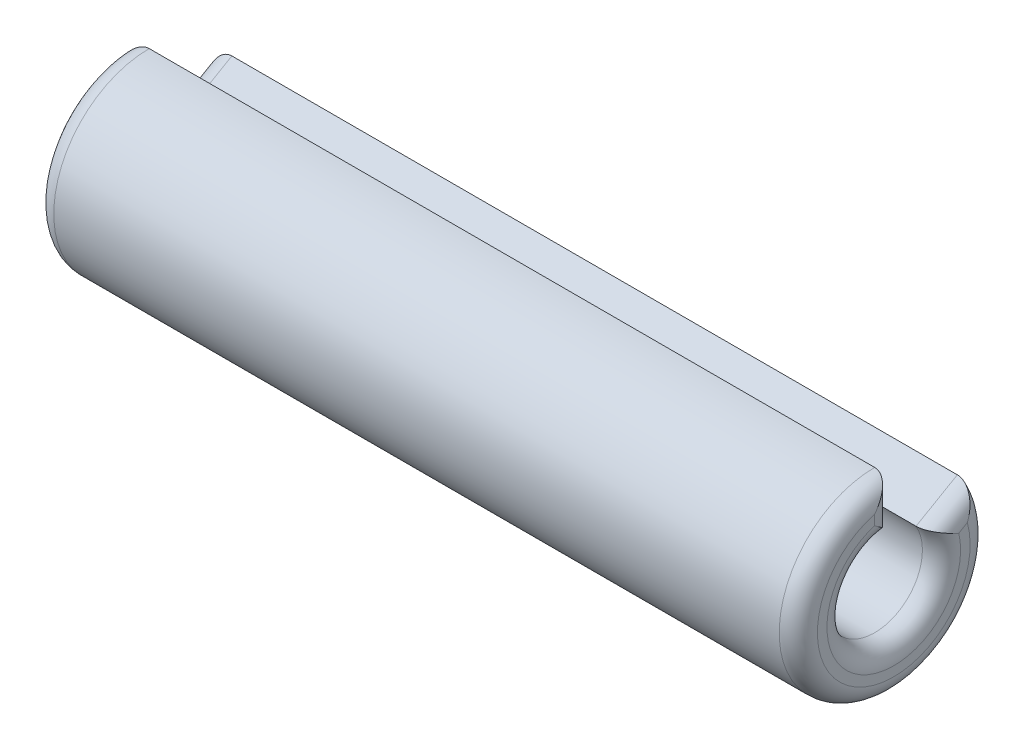
ISO-10303-21;
HEADER;
FILE_DESCRIPTION(('STEP AP214'),'2;1');
FILE_NAME('part.step','',(''),(''),'','','');
FILE_SCHEMA(('AUTOMOTIVE_DESIGN { 1 0 10303 214 1 1 1 1 }'));
ENDSEC;
DATA;
#1=APPLICATION_CONTEXT('core data for automotive mechanical design processes');
#2=APPLICATION_PROTOCOL_DEFINITION('international standard','automotive_design',2000,#1);
#3=PRODUCT_CONTEXT('',#1,'mechanical');
#4=PRODUCT('Part','Part','',(#3));
#5=PRODUCT_RELATED_PRODUCT_CATEGORY('part','',(#4));
#6=PRODUCT_DEFINITION_FORMATION('','',#4);
#7=PRODUCT_DEFINITION_CONTEXT('part definition',#1,'design');
#8=PRODUCT_DEFINITION('design','',#6,#7);
#9=PRODUCT_DEFINITION_SHAPE('','',#8);
#10=(LENGTH_UNIT() NAMED_UNIT(*) SI_UNIT(.MILLI.,.METRE.));
#11=(NAMED_UNIT(*) PLANE_ANGLE_UNIT() SI_UNIT($,.RADIAN.));
#12=(NAMED_UNIT(*) SI_UNIT($,.STERADIAN.) SOLID_ANGLE_UNIT());
#13=UNCERTAINTY_MEASURE_WITH_UNIT(LENGTH_MEASURE(1.E-05),#10,'distance_accuracy_value','');
#14=(GEOMETRIC_REPRESENTATION_CONTEXT(3) GLOBAL_UNCERTAINTY_ASSIGNED_CONTEXT((#13)) GLOBAL_UNIT_ASSIGNED_CONTEXT((#10,
#11,#12)) REPRESENTATION_CONTEXT('',''));
#15=CARTESIAN_POINT('',(0.,0.,0.));
#16=DIRECTION('',(0.,0.,1.));
#17=DIRECTION('',(1.,0.,0.));
#18=AXIS2_PLACEMENT_3D('',#15,#16,#17);
#19=CARTESIAN_POINT('',(-2.,0.250000000000005,-0.433012701892216));
#20=DIRECTION('',(1.,0.,0.));
#21=DIRECTION('',(0.,0.,-1.));
#22=AXIS2_PLACEMENT_3D('',#19,#20,#21);
#23=PLANE('',#22);
#24=CARTESIAN_POINT('',(-2.,0.,0.));
#25=DIRECTION('',(1.,0.,0.));
#26=DIRECTION('',(0.,0.,-1.));
#27=AXIS2_PLACEMENT_3D('',#24,#25,#26);
#28=CIRCLE('',#27,0.4);
#29=CARTESIAN_POINT('',(-2.,0.107046626931931,-0.385410196624967));
#30=VERTEX_POINT('',#29);
#31=CARTESIAN_POINT('',(-2.,0.387298334620742,0.1));
#32=VERTEX_POINT('',#31);
#33=EDGE_CURVE('E122',#30,#32,#28,.F.);
#34=ORIENTED_EDGE('',*,*,#33,.T.);
#35=DIRECTION('',(0.,-1.,0.));
#36=VECTOR('',#35,1.);
#37=CARTESIAN_POINT('',(-2.,0.250000000000005,0.1));
#38=LINE('',#37,#36);
#39=CARTESIAN_POINT('',(-2.,0.335410196624968,0.1));
#40=VERTEX_POINT('',#39);
#41=EDGE_CURVE('E104',#32,#40,#38,.T.);
#42=ORIENTED_EDGE('',*,*,#41,.T.);
#43=CARTESIAN_POINT('',(-2.,0.,0.));
#44=DIRECTION('',(1.,0.,0.));
#45=DIRECTION('',(0.,0.,-1.));
#46=AXIS2_PLACEMENT_3D('',#43,#44,#45);
#47=CIRCLE('',#46,0.35);
#48=CARTESIAN_POINT('',(-2.,0.0811025579340443,-0.340473750965555));
#49=VERTEX_POINT('',#48);
#50=EDGE_CURVE('E112',#40,#49,#47,.T.);
#51=ORIENTED_EDGE('',*,*,#50,.T.);
#52=DIRECTION('',(0.,-0.50000000000001,0.866025403784433));
#53=VECTOR('',#52,1.);
#54=CARTESIAN_POINT('',(-2.,0.163397459621562,-0.483012701892217));
#55=LINE('',#54,#53);
#56=EDGE_CURVE('E118',#49,#30,#55,.F.);
#57=ORIENTED_EDGE('',*,*,#56,.T.);
#58=EDGE_LOOP('',(#34,#42,#51,#57));
#59=FACE_BOUND('',#58,.T.);
#60=ADVANCED_FACE('F30',(#59),#23,.F.);
#61=CARTESIAN_POINT('',(0.,0.,0.));
#62=DIRECTION('',(-1.,0.,0.));
#63=DIRECTION('',(0.,0.,1.));
#64=AXIS2_PLACEMENT_3D('',#61,#62,#63);
#65=CYLINDRICAL_SURFACE('',#64,0.25);
#66=DIRECTION('',(1.,0.,0.));
#67=VECTOR('',#66,1.);
#68=CARTESIAN_POINT('',(-2.,0.125000000000003,-0.216506350946108));
#69=LINE('',#68,#67);
#70=CARTESIAN_POINT('',(-1.9,0.125000000000003,-0.216506350946108));
#71=VERTEX_POINT('',#70);
#72=CARTESIAN_POINT('',(1.9,0.125000000000003,-0.216506350946108));
#73=VERTEX_POINT('',#72);
#74=EDGE_CURVE('E247',#71,#73,#69,.T.);
#75=ORIENTED_EDGE('',*,*,#74,.F.);
#76=CARTESIAN_POINT('',(-1.9,0.,0.));
#77=DIRECTION('',(1.,0.,0.));
#78=DIRECTION('',(0.,0.,-1.));
#79=AXIS2_PLACEMENT_3D('',#76,#77,#78);
#80=CIRCLE('',#79,0.25);
#81=CARTESIAN_POINT('',(-1.9,0.25,0.));
#82=VERTEX_POINT('',#81);
#83=EDGE_CURVE('E142',#71,#82,#80,.F.);
#84=ORIENTED_EDGE('',*,*,#83,.T.);
#85=DIRECTION('',(1.,0.,0.));
#86=VECTOR('',#85,1.);
#87=CARTESIAN_POINT('',(-2.,0.25,0.));
#88=LINE('',#87,#86);
#89=CARTESIAN_POINT('',(1.9,0.25,0.));
#90=VERTEX_POINT('',#89);
#91=EDGE_CURVE('E253',#82,#90,#88,.T.);
#92=ORIENTED_EDGE('',*,*,#91,.T.);
#93=CARTESIAN_POINT('',(1.9,0.,0.));
#94=DIRECTION('',(-1.,0.,0.));
#95=DIRECTION('',(0.,0.,1.));
#96=AXIS2_PLACEMENT_3D('',#93,#94,#95);
#97=CIRCLE('',#96,0.25);
#98=EDGE_CURVE('E140',#90,#73,#97,.F.);
#99=ORIENTED_EDGE('',*,*,#98,.T.);
#100=EDGE_LOOP('',(#75,#84,#92,#99));
#101=FACE_BOUND('',#100,.T.);
#102=ADVANCED_FACE('F216',(#101),#65,.F.);
#103=CARTESIAN_POINT('',(2.,0.250000000000005,-0.433012701892216));
#104=DIRECTION('',(-1.,0.,0.));
#105=DIRECTION('',(0.,0.,1.));
#106=AXIS2_PLACEMENT_3D('',#103,#104,#105);
#107=PLANE('',#106);
#108=CARTESIAN_POINT('',(2.,0.,0.));
#109=DIRECTION('',(-1.,0.,0.));
#110=DIRECTION('',(0.,0.,1.));
#111=AXIS2_PLACEMENT_3D('',#108,#109,#110);
#112=CIRCLE('',#111,0.35);
#113=CARTESIAN_POINT('',(2.,0.0811025579340443,-0.340473750965555));
#114=VERTEX_POINT('',#113);
#115=CARTESIAN_POINT('',(2.,0.335410196624968,0.1));
#116=VERTEX_POINT('',#115);
#117=EDGE_CURVE('E43',#114,#116,#112,.T.);
#118=ORIENTED_EDGE('',*,*,#117,.T.);
#119=DIRECTION('',(0.,1.,0.));
#120=VECTOR('',#119,1.);
#121=CARTESIAN_POINT('',(2.,0.250000000000005,0.1));
#122=LINE('',#121,#120);
#123=CARTESIAN_POINT('',(2.,0.387298334620742,0.1));
#124=VERTEX_POINT('',#123);
#125=EDGE_CURVE('E11',#116,#124,#122,.T.);
#126=ORIENTED_EDGE('',*,*,#125,.T.);
#127=CARTESIAN_POINT('',(2.,0.,0.));
#128=DIRECTION('',(-1.,0.,0.));
#129=DIRECTION('',(0.,0.,1.));
#130=AXIS2_PLACEMENT_3D('',#127,#128,#129);
#131=CIRCLE('',#130,0.4);
#132=CARTESIAN_POINT('',(2.,0.107046626931931,-0.385410196624967));
#133=VERTEX_POINT('',#132);
#134=EDGE_CURVE('E144',#124,#133,#131,.F.);
#135=ORIENTED_EDGE('',*,*,#134,.T.);
#136=DIRECTION('',(0.,0.50000000000001,-0.866025403784433));
#137=VECTOR('',#136,1.);
#138=CARTESIAN_POINT('',(2.,0.0383974596215593,-0.266506350946109));
#139=LINE('',#138,#137);
#140=EDGE_CURVE('E54',#133,#114,#139,.F.);
#141=ORIENTED_EDGE('',*,*,#140,.T.);
#142=EDGE_LOOP('',(#118,#126,#135,#141));
#143=FACE_BOUND('',#142,.T.);
#144=ADVANCED_FACE('F221',(#143),#107,.F.);
#145=CARTESIAN_POINT('',(0.,0.,0.));
#146=DIRECTION('',(-1.,0.,0.));
#147=DIRECTION('',(0.,0.,1.));
#148=AXIS2_PLACEMENT_3D('',#145,#146,#147);
#149=CYLINDRICAL_SURFACE('',#148,0.5);
#150=DIRECTION('',(-1.,0.,0.));
#151=VECTOR('',#150,1.);
#152=CARTESIAN_POINT('',(-2.,0.5,0.));
#153=LINE('',#152,#151);
#154=CARTESIAN_POINT('',(1.9,0.5,0.));
#155=VERTEX_POINT('',#154);
#156=CARTESIAN_POINT('',(-1.9,0.5,0.));
#157=VERTEX_POINT('',#156);
#158=EDGE_CURVE('E255',#155,#157,#153,.T.);
#159=ORIENTED_EDGE('',*,*,#158,.T.);
#160=CARTESIAN_POINT('',(-1.9,0.,0.));
#161=DIRECTION('',(1.,0.,0.));
#162=DIRECTION('',(0.,0.,-1.));
#163=AXIS2_PLACEMENT_3D('',#160,#161,#162);
#164=CIRCLE('',#163,0.5);
#165=CARTESIAN_POINT('',(-1.9,0.250000000000005,-0.433012701892216));
#166=VERTEX_POINT('',#165);
#167=EDGE_CURVE('E134',#157,#166,#164,.T.);
#168=ORIENTED_EDGE('',*,*,#167,.T.);
#169=DIRECTION('',(-1.,0.,0.));
#170=VECTOR('',#169,1.);
#171=CARTESIAN_POINT('',(-2.,0.250000000000005,-0.433012701892216));
#172=LINE('',#171,#170);
#173=CARTESIAN_POINT('',(1.9,0.250000000000005,-0.433012701892216));
#174=VERTEX_POINT('',#173);
#175=EDGE_CURVE('E119',#174,#166,#172,.T.);
#176=ORIENTED_EDGE('',*,*,#175,.F.);
#177=CARTESIAN_POINT('',(1.9,0.,0.));
#178=DIRECTION('',(-1.,0.,0.));
#179=DIRECTION('',(0.,0.,1.));
#180=AXIS2_PLACEMENT_3D('',#177,#178,#179);
#181=CIRCLE('',#180,0.5);
#182=EDGE_CURVE('E132',#174,#155,#181,.T.);
#183=ORIENTED_EDGE('',*,*,#182,.T.);
#184=EDGE_LOOP('',(#159,#168,#176,#183));
#185=FACE_BOUND('',#184,.T.);
#186=ADVANCED_FACE('F227',(#185),#149,.T.);
#187=CARTESIAN_POINT('',(-2.,0.125000000000003,-0.216506350946108));
#188=DIRECTION('',(0.,0.866025403784433,0.50000000000001));
#189=DIRECTION('',(1.,0.,0.));
#190=AXIS2_PLACEMENT_3D('',#187,#188,#189);
#191=PLANE('',#190);
#192=ORIENTED_EDGE('',*,*,#175,.T.);
#193=DIRECTION('',(0.,-0.50000000000001,0.866025403784433));
#194=VECTOR('',#193,1.);
#195=CARTESIAN_POINT('',(-1.9,0.125000000000003,-0.216506350946108));
#196=LINE('',#195,#194);
#197=EDGE_CURVE('E138',#166,#71,#196,.T.);
#198=ORIENTED_EDGE('',*,*,#197,.T.);
#199=ORIENTED_EDGE('',*,*,#74,.T.);
#200=DIRECTION('',(0.,0.50000000000001,-0.866025403784433));
#201=VECTOR('',#200,1.);
#202=CARTESIAN_POINT('',(1.9,0.250000000000005,-0.433012701892216));
#203=LINE('',#202,#201);
#204=EDGE_CURVE('E136',#73,#174,#203,.T.);
#205=ORIENTED_EDGE('',*,*,#204,.T.);
#206=EDGE_LOOP('',(#192,#198,#199,#205));
#207=FACE_BOUND('',#206,.T.);
#208=ADVANCED_FACE('F225',(#207),#191,.T.);
#209=CARTESIAN_POINT('',(-2.,0.25,0.));
#210=DIRECTION('',(0.,0.,1.));
#211=DIRECTION('',(1.,0.,0.));
#212=AXIS2_PLACEMENT_3D('',#209,#210,#211);
#213=PLANE('',#212);
#214=ORIENTED_EDGE('',*,*,#91,.F.);
#215=DIRECTION('',(0.,-1.,0.));
#216=VECTOR('',#215,1.);
#217=CARTESIAN_POINT('',(-1.9,0.25,0.));
#218=LINE('',#217,#216);
#219=EDGE_CURVE('E106',#82,#157,#218,.F.);
#220=ORIENTED_EDGE('',*,*,#219,.T.);
#221=ORIENTED_EDGE('',*,*,#158,.F.);
#222=DIRECTION('',(0.,1.,0.));
#223=VECTOR('',#222,1.);
#224=CARTESIAN_POINT('',(1.9,0.25,0.));
#225=LINE('',#224,#223);
#226=EDGE_CURVE('E124',#155,#90,#225,.F.);
#227=ORIENTED_EDGE('',*,*,#226,.T.);
#228=EDGE_LOOP('',(#214,#220,#221,#227));
#229=FACE_BOUND('',#228,.T.);
#230=ADVANCED_FACE('F179',(#229),#213,.F.);
#231=CARTESIAN_POINT('',(-1.9,0.0383974596215592,-0.266506350946109));
#232=DIRECTION('',(0.,0.50000000000001,-0.866025403784433));
#233=DIRECTION('',(0.,0.866025403784433,0.50000000000001));
#234=AXIS2_PLACEMENT_3D('',#231,#232,#233);
#235=CYLINDRICAL_SURFACE('',#234,0.1);
#236=CARTESIAN_POINT('',(-1.9,0.125000000000003,-0.216506350946108));
#237=CARTESIAN_POINT('',(-1.90456302756111,0.125001846126447,-0.216494414314458));
#238=CARTESIAN_POINT('',(-1.90911209628744,0.124885941356571,-0.216932289486175));
#239=CARTESIAN_POINT('',(-1.91800793867544,0.124436218306633,-0.218600851008894));
#240=CARTESIAN_POINT('',(-1.92235624073152,0.124104513430904,-0.219823846881831));
#241=CARTESIAN_POINT('',(-1.93075485468525,0.1232416813414,-0.222954101837193));
#242=CARTESIAN_POINT('',(-1.93480613495911,0.122711240113996,-0.224859006152433));
#243=CARTESIAN_POINT('',(-1.94257414437538,0.121469963836108,-0.229226807603817));
#244=CARTESIAN_POINT('',(-1.94628994923974,0.120758649846192,-0.231691184300236));
#245=CARTESIAN_POINT('',(-1.9548971756463,0.118826508796701,-0.238235481000178));
#246=CARTESIAN_POINT('',(-1.95959059909023,0.117518979794113,-0.242550216541672));
#247=CARTESIAN_POINT('',(-1.96819791222814,0.114612638410824,-0.251811757344407));
#248=CARTESIAN_POINT('',(-1.97211030317757,0.113013277065142,-0.256759748492498));
#249=CARTESIAN_POINT('',(-1.98016357197152,0.109069218443739,-0.268553209847667));
#250=CARTESIAN_POINT('',(-1.98405694900438,0.106641588043178,-0.27553992102465));
#251=CARTESIAN_POINT('',(-1.99059463396781,0.101427847577215,-0.289943607553397));
#252=CARTESIAN_POINT('',(-1.99323890807961,0.0986417278085076,-0.297360594548541));
#253=CARTESIAN_POINT('',(-1.99673931089136,0.0935466254452119,-0.310438974944341));
#254=CARTESIAN_POINT('',(-1.99788234337528,0.0913036962426054,-0.316051607779381));
#255=CARTESIAN_POINT('',(-1.99946510394331,0.0866915456023333,-0.327314916655244));
#256=CARTESIAN_POINT('',(-1.99990626252729,0.0843225912349837,-0.332965491685404));
#257=CARTESIAN_POINT('',(-1.9999955306022,0.0816407650639417,-0.339222601944416));
#258=CARTESIAN_POINT('',(-2.00000000243457,0.0813719227493759,-0.339848326789207));
#259=CARTESIAN_POINT('',(-2.,0.0811025579340443,-0.340473750965555));
#260=B_SPLINE_CURVE_WITH_KNOTS('',3,(#236,#237,#238,#239,#240,#241,#242,#243,#244,#245,#246,
#247,#248,#249,#250,#251,#252,#253,#254,#255,#256,#257,#258,#259),.UNSPECIFIED.,.F.,.F.,(4,2,2,
2,2,2,2,2,2,2,2,4),(0.,0.0136445333148617,0.0271574126492994,0.0406240724276752,
0.0541267692939512,0.07354405862739,0.0929982575441901,0.117946452550221,0.142895322976325,
0.161312340928773,0.179691774569601,0.181734854671988),.UNSPECIFIED.);
#261=EDGE_CURVE('E115',#71,#49,#260,.T.);
#262=ORIENTED_EDGE('',*,*,#261,.F.);
#263=ORIENTED_EDGE('',*,*,#197,.F.);
#264=CARTESIAN_POINT('',(-1.9,0.250000000000005,-0.433012701892216));
#265=CARTESIAN_POINT('',(-1.90444877756569,0.250009845945404,-0.433014663848405));
#266=CARTESIAN_POINT('',(-1.9088874082824,0.249595173798864,-0.43290424368079));
#267=CARTESIAN_POINT('',(-1.91757918003461,0.248001328677185,-0.432476010184327));
#268=CARTESIAN_POINT('',(-1.92183353346973,0.246828383188893,-0.432159886106763));
#269=CARTESIAN_POINT('',(-1.93005805470556,0.243803736525012,-0.431338112844119));
#270=CARTESIAN_POINT('',(-1.93402887714949,0.241953663603323,-0.430832918242144));
#271=CARTESIAN_POINT('',(-1.94163135911145,0.23768636962258,-0.42965496092367));
#272=CARTESIAN_POINT('',(-1.94526230385266,0.235267989268773,-0.428981855509532));
#273=CARTESIAN_POINT('',(-1.95345461812463,0.228967517277315,-0.427205526685794));
#274=CARTESIAN_POINT('',(-1.95784271161327,0.224878950137412,-0.426036168440128));
#275=CARTESIAN_POINT('',(-1.96587828900347,0.216093746325443,-0.423470089123617));
#276=CARTESIAN_POINT('',(-1.96952442844103,0.21139603061145,-0.422072963429442));
#277=CARTESIAN_POINT('',(-1.97749282347439,0.199536603688889,-0.418463885249741));
#278=CARTESIAN_POINT('',(-1.98145967571788,0.192166333616738,-0.416155588409885));
#279=CARTESIAN_POINT('',(-1.98814059276331,0.176980810976571,-0.411228387441944));
#280=CARTESIAN_POINT('',(-1.99085250669685,0.169164820033598,-0.40860895964166));
#281=CARTESIAN_POINT('',(-1.99536996564037,0.152631845525194,-0.402862548964247));
#282=CARTESIAN_POINT('',(-1.9970742177348,0.143896284932633,-0.399711168616634));
#283=CARTESIAN_POINT('',(-1.99934857403429,0.126398738700875,-0.393138553137901));
#284=CARTESIAN_POINT('',(-1.99992039179072,0.117636813109582,-0.38971773387909));
#285=CARTESIAN_POINT('',(-1.99999741187534,0.108301079368868,-0.385922387447433));
#286=CARTESIAN_POINT('',(-1.99999999260017,0.107673699478716,-0.385666598780164));
#287=CARTESIAN_POINT('',(-2.,0.107046626931931,-0.385410196624967));
#288=B_SPLINE_CURVE_WITH_KNOTS('',3,(#264,#265,#266,#267,#268,#269,#270,#271,#272,#273,#274,
#275,#276,#277,#278,#279,#280,#281,#282,#283,#284,#285,#286,#287),.UNSPECIFIED.,.F.,.F.,(4,2,2,
2,2,2,2,2,2,2,2,4),(0.,0.0133095954523558,0.0265112481653455,0.0396813618949324,
0.0528785782973632,0.0711089345825428,0.0893720368026104,0.115276439704154,0.141225077815645,
0.16946715401447,0.197666462755551,0.199699009607573),.UNSPECIFIED.);
#289=EDGE_CURVE('E170',#30,#166,#288,.F.);
#290=ORIENTED_EDGE('',*,*,#289,.F.);
#291=ORIENTED_EDGE('',*,*,#56,.F.);
#292=EDGE_LOOP('',(#262,#263,#290,#291));
#293=FACE_BOUND('',#292,.T.);
#294=ADVANCED_FACE('F175',(#293),#235,.T.);
#295=CARTESIAN_POINT('',(-1.9,0.,0.));
#296=DIRECTION('',(1.,0.,0.));
#297=DIRECTION('',(0.,0.,-1.));
#298=AXIS2_PLACEMENT_3D('',#295,#296,#297);
#299=TOROIDAL_SURFACE('',#298,0.4,0.1);
#300=ORIENTED_EDGE('',*,*,#289,.T.);
#301=ORIENTED_EDGE('',*,*,#167,.F.);
#302=CARTESIAN_POINT('',(-1.9,0.5,0.));
#303=CARTESIAN_POINT('',(-1.90444877756569,0.5000066220766,-7.54586074524585E-06));
#304=CARTESIAN_POINT('',(-1.9088874082824,0.499703659333085,0.000296360668592614));
#305=CARTESIAN_POINT('',(-1.91757918003461,0.498535875685557,0.00146255428543302));
#306=CARTESIAN_POINT('',(-1.92183353346973,0.497675631459493,0.00232029283676642));
#307=CARTESIAN_POINT('',(-1.93005805470556,0.495451631605952,0.00452882705383699));
#308=CARTESIAN_POINT('',(-1.93402887714949,0.494089083785942,0.00587843990188613));
#309=CARTESIAN_POINT('',(-1.94163135911145,0.490935295833199,0.00898504623538839));
#310=CARTESIAN_POINT('',(-1.94526230385266,0.489143179268227,0.0107428723507298));
#311=CARTESIAN_POINT('',(-1.95345461812463,0.484454597385666,0.0153110767392955));
#312=CARTESIAN_POINT('',(-1.95784271161327,0.481397619868843,0.0182672006246963));
#313=CARTESIAN_POINT('',(-1.96587828900347,0.474782728086634,0.0245923706450299));
#314=CARTESIAN_POINT('',(-1.96952442844103,0.471223923886202,0.0279621489460179));
#315=CARTESIAN_POINT('',(-1.97749282347439,0.462168657037057,0.0364281748454303));
#316=CARTESIAN_POINT('',(-1.98145967571788,0.45648447829819,0.0416568675407368));
#317=CARTESIAN_POINT('',(-1.98814059276331,0.444624635770318,0.0523443154328949));
#318=CARTESIAN_POINT('',(-1.99085250669685,0.438448149280407,0.0578034482451166));
#319=CARTESIAN_POINT('',(-1.99536996564037,0.425205124398986,0.0692482188308079));
#320=CARTESIAN_POINT('',(-1.9970742177348,0.418108168664686,0.0752377460464567));
#321=CARTESIAN_POINT('',(-1.99934857403429,0.403667343574918,0.0871047578476865));
#322=CARTESIAN_POINT('',(-1.99992039179072,0.396323864399387,0.0929823983664122));
#323=CARTESIAN_POINT('',(-1.99999741187534,0.38836913110305,0.099169707733007));
#324=CARTESIAN_POINT('',(-1.99999999260017,0.387833921674119,0.0995851403220671));
#325=CARTESIAN_POINT('',(-2.,0.387298334620742,0.1));
#326=B_SPLINE_CURVE_WITH_KNOTS('',3,(#302,#303,#304,#305,#306,#307,#308,#309,#310,#311,#312,
#313,#314,#315,#316,#317,#318,#319,#320,#321,#322,#323,#324,#325),.UNSPECIFIED.,.F.,.F.,(4,2,2,
2,2,2,2,2,2,2,2,4),(0.,0.0133095954523558,0.0265112481653455,0.0396813618949324,
0.0528785782973631,0.0711089345825428,0.0893720368026103,0.115276439704153,0.141225077815645,
0.16946715401447,0.197666462755551,0.199699009607573),.UNSPECIFIED.);
#327=EDGE_CURVE('E109',#32,#157,#326,.F.);
#328=ORIENTED_EDGE('',*,*,#327,.F.);
#329=ORIENTED_EDGE('',*,*,#33,.F.);
#330=EDGE_LOOP('',(#300,#301,#328,#329));
#331=FACE_BOUND('',#330,.T.);
#332=ADVANCED_FACE('F162',(#331),#299,.T.);
#333=CARTESIAN_POINT('',(-1.9,0.,0.));
#334=DIRECTION('',(1.,0.,0.));
#335=DIRECTION('',(0.,0.,-1.));
#336=AXIS2_PLACEMENT_3D('',#333,#334,#335);
#337=TOROIDAL_SURFACE('',#336,0.35,0.1);
#338=ORIENTED_EDGE('',*,*,#261,.T.);
#339=ORIENTED_EDGE('',*,*,#50,.F.);
#340=CARTESIAN_POINT('',(-1.9,0.25,0.));
#341=CARTESIAN_POINT('',(-1.90456302756111,0.249990585636977,-7.56710822440766E-06));
#342=CARTESIAN_POINT('',(-1.90911209628744,0.250311844274433,0.000311746952766208));
#343=CARTESIAN_POINT('',(-1.91800793867544,0.251531999415916,0.0015354993000397));
#344=CARTESIAN_POINT('',(-1.92235624073152,0.252425292472738,0.00243426208544814));
#345=CARTESIAN_POINT('',(-1.93075485468525,0.254704756739652,0.0047466240718408));
#346=CARTESIAN_POINT('',(-1.93480613495911,0.256089231654727,0.00615845180760723));
#347=CARTESIAN_POINT('',(-1.94257414437538,0.259251220531367,0.00941732932306482));
#348=CARTESIAN_POINT('',(-1.94628994923974,0.261029776360002,0.0112655336566094));
#349=CARTESIAN_POINT('',(-1.9548971756463,0.26573123302731,0.0162109652391339));
#350=CARTESIAN_POINT('',(-1.95959059909023,0.268814139115561,0.0195006863423078));
#351=CARTESIAN_POINT('',(-1.96819791222814,0.275381698037271,0.0266484222136734));
#352=CARTESIAN_POINT('',(-1.97211030317757,0.278867103396377,0.0305075053429097));
#353=CARTESIAN_POINT('',(-1.98016357197152,0.287108511217802,0.0398198909806444));
#354=CARTESIAN_POINT('',(-1.98405694900438,0.291945365385693,0.0454156361670212));
#355=CARTESIAN_POINT('',(-1.99059463396781,0.301812453594755,0.0571327111236576));
#356=CARTESIAN_POINT('',(-1.99323890807961,0.306842692867734,0.0632540551189167));
#357=CARTESIAN_POINT('',(-1.99673931089136,0.315621351349205,0.0742057333983129));
#358=CARTESIAN_POINT('',(-1.99788234337528,0.319360569365161,0.0789544834841806));
#359=CARTESIAN_POINT('',(-1.99946510394331,0.326808805662193,0.088580377542668));
#360=CARTESIAN_POINT('',(-1.99990626252729,0.330517870000627,0.0934572397202784));
#361=CARTESIAN_POINT('',(-1.9999955306022,0.334595773353691,0.0989083244424413));
#362=CARTESIAN_POINT('',(-2.00000000243457,0.335003245807776,0.0994540111388631));
#363=CARTESIAN_POINT('',(-2.,0.335410196624968,0.1));
#364=B_SPLINE_CURVE_WITH_KNOTS('',3,(#340,#341,#342,#343,#344,#345,#346,#347,#348,#349,#350,
#351,#352,#353,#354,#355,#356,#357,#358,#359,#360,#361,#362,#363),.UNSPECIFIED.,.F.,.F.,(4,2,2,
2,2,2,2,2,2,2,2,4),(0.,0.0136445333148617,0.0271574126492994,0.0406240724276749,
0.0541267692939512,0.07354405862739,0.0929982575441901,0.117946452550221,0.142895322976325,
0.161312340928773,0.179691774569601,0.181734854671988),.UNSPECIFIED.);
#365=EDGE_CURVE('E100',#82,#40,#364,.T.);
#366=ORIENTED_EDGE('',*,*,#365,.F.);
#367=ORIENTED_EDGE('',*,*,#83,.F.);
#368=EDGE_LOOP('',(#338,#339,#366,#367));
#369=FACE_BOUND('',#368,.T.);
#370=ADVANCED_FACE('F113',(#369),#337,.T.);
#371=CARTESIAN_POINT('',(-1.9,0.250000000000005,0.1));
#372=DIRECTION('',(0.,-1.,0.));
#373=DIRECTION('',(0.,0.,-1.));
#374=AXIS2_PLACEMENT_3D('',#371,#372,#373);
#375=CYLINDRICAL_SURFACE('',#374,0.1);
#376=ORIENTED_EDGE('',*,*,#327,.T.);
#377=ORIENTED_EDGE('',*,*,#219,.F.);
#378=ORIENTED_EDGE('',*,*,#365,.T.);
#379=ORIENTED_EDGE('',*,*,#41,.F.);
#380=EDGE_LOOP('',(#376,#377,#378,#379));
#381=FACE_BOUND('',#380,.T.);
#382=ADVANCED_FACE('F102',(#381),#375,.T.);
#383=CARTESIAN_POINT('',(1.9,0.0383974596215592,-0.266506350946109));
#384=DIRECTION('',(0.,-0.50000000000001,0.866025403784433));
#385=DIRECTION('',(0.,-0.866025403784433,-0.50000000000001));
#386=AXIS2_PLACEMENT_3D('',#383,#384,#385);
#387=CYLINDRICAL_SURFACE('',#386,0.1);
#388=CARTESIAN_POINT('',(1.9,0.250000000000005,-0.433012701892216));
#389=CARTESIAN_POINT('',(1.90444877756568,0.250009845945404,-0.433014663848405));
#390=CARTESIAN_POINT('',(1.9088874082824,0.249595173798864,-0.43290424368079));
#391=CARTESIAN_POINT('',(1.91757918003461,0.248001328677185,-0.432476010184327));
#392=CARTESIAN_POINT('',(1.92183353346973,0.246828383188893,-0.432159886106763));
#393=CARTESIAN_POINT('',(1.93005805470556,0.243803736525012,-0.431338112844119));
#394=CARTESIAN_POINT('',(1.93402887714949,0.241953663603323,-0.430832918242145));
#395=CARTESIAN_POINT('',(1.94163135911145,0.237686369622581,-0.42965496092367));
#396=CARTESIAN_POINT('',(1.94526230385266,0.235267989268773,-0.428981855509532));
#397=CARTESIAN_POINT('',(1.95345461812463,0.228967517277315,-0.427205526685794));
#398=CARTESIAN_POINT('',(1.95784271161327,0.224878950137413,-0.426036168440128));
#399=CARTESIAN_POINT('',(1.96587828900347,0.216093746325444,-0.423470089123617));
#400=CARTESIAN_POINT('',(1.96952442844103,0.211396030611451,-0.422072963429443));
#401=CARTESIAN_POINT('',(1.97749282347439,0.19953660368889,-0.418463885249742));
#402=CARTESIAN_POINT('',(1.98145967571788,0.19216633361674,-0.416155588409884));
#403=CARTESIAN_POINT('',(1.98814059276331,0.176980810976571,-0.411228387441945));
#404=CARTESIAN_POINT('',(1.99085250669685,0.169164820033597,-0.408608959641664));
#405=CARTESIAN_POINT('',(1.99536996564037,0.152631845525196,-0.402862548964243));
#406=CARTESIAN_POINT('',(1.99707421773481,0.143896284932639,-0.39971116861662));
#407=CARTESIAN_POINT('',(1.99934857403429,0.126398738700869,-0.393138553137916));
#408=CARTESIAN_POINT('',(1.99992039179071,0.117636813109559,-0.389717733879145));
#409=CARTESIAN_POINT('',(1.99999741187534,0.108301079368865,-0.38592238744744));
#410=CARTESIAN_POINT('',(1.99999999260017,0.107673699478715,-0.385666598780168));
#411=CARTESIAN_POINT('',(2.,0.107046626931931,-0.385410196624967));
#412=B_SPLINE_CURVE_WITH_KNOTS('',3,(#388,#389,#390,#391,#392,#393,#394,#395,#396,#397,#398,
#399,#400,#401,#402,#403,#404,#405,#406,#407,#408,#409,#410,#411),.UNSPECIFIED.,.F.,.F.,(4,2,2,
2,2,2,2,2,2,2,2,4),(0.,0.0133095954523558,0.0265112481653454,0.0396813618949323,
0.052878578297363,0.0711089345825427,0.08937203680261,0.115276439704153,0.141225077815645,
0.169467154014471,0.197666462755552,0.199699009607573),.UNSPECIFIED.);
#413=EDGE_CURVE('E199',#174,#133,#412,.T.);
#414=ORIENTED_EDGE('',*,*,#413,.F.);
#415=ORIENTED_EDGE('',*,*,#204,.F.);
#416=CARTESIAN_POINT('',(1.9,0.125000000000003,-0.216506350946108));
#417=CARTESIAN_POINT('',(1.90456302756111,0.125001846126447,-0.216494414314458));
#418=CARTESIAN_POINT('',(1.90911209628744,0.124885941356571,-0.216932289486175));
#419=CARTESIAN_POINT('',(1.91800793867544,0.124436218306633,-0.218600851008894));
#420=CARTESIAN_POINT('',(1.92235624073152,0.124104513430904,-0.21982384688183));
#421=CARTESIAN_POINT('',(1.93075485468525,0.1232416813414,-0.222954101837193));
#422=CARTESIAN_POINT('',(1.93480613495911,0.122711240113996,-0.224859006152433));
#423=CARTESIAN_POINT('',(1.94257414437538,0.121469963836108,-0.229226807603817));
#424=CARTESIAN_POINT('',(1.94628994923974,0.120758649846191,-0.231691184300236));
#425=CARTESIAN_POINT('',(1.9548971756463,0.118826508796701,-0.238235481000178));
#426=CARTESIAN_POINT('',(1.95959059909023,0.117518979794113,-0.242550216541672));
#427=CARTESIAN_POINT('',(1.96819791222814,0.114612638410824,-0.251811757344406));
#428=CARTESIAN_POINT('',(1.97211030317757,0.113013277065142,-0.256759748492497));
#429=CARTESIAN_POINT('',(1.98016357197152,0.10906921844374,-0.268553209847666));
#430=CARTESIAN_POINT('',(1.98405694900438,0.106641588043179,-0.275539921024649));
#431=CARTESIAN_POINT('',(1.99059463396781,0.101427847577214,-0.289943607553396));
#432=CARTESIAN_POINT('',(1.9932389080796,0.0986417278085043,-0.297360594548539));
#433=CARTESIAN_POINT('',(1.99673931089136,0.0935466254452142,-0.31043897494434));
#434=CARTESIAN_POINT('',(1.99788234337528,0.0913036962426133,-0.316051607779383));
#435=CARTESIAN_POINT('',(1.99946510394331,0.0866915456023243,-0.327314916655239));
#436=CARTESIAN_POINT('',(1.99990626252729,0.0843225912349522,-0.33296549168539));
#437=CARTESIAN_POINT('',(1.9999955306022,0.081640765063935,-0.339222601944413));
#438=CARTESIAN_POINT('',(2.00000000243457,0.0813719227493722,-0.339848326789206));
#439=CARTESIAN_POINT('',(2.,0.0811025579340443,-0.340473750965555));
#440=B_SPLINE_CURVE_WITH_KNOTS('',3,(#416,#417,#418,#419,#420,#421,#422,#423,#424,#425,#426,
#427,#428,#429,#430,#431,#432,#433,#434,#435,#436,#437,#438,#439),.UNSPECIFIED.,.F.,.F.,(4,2,2,
2,2,2,2,2,2,2,2,4),(0.,0.0136445333148617,0.0271574126492994,0.0406240724276752,
0.0541267692939511,0.0735440586273892,0.0929982575441893,0.117946452550221,0.142895322976324,
0.161312340928772,0.179691774569601,0.181734854671988),.UNSPECIFIED.);
#441=EDGE_CURVE('E35',#114,#73,#440,.F.);
#442=ORIENTED_EDGE('',*,*,#441,.F.);
#443=ORIENTED_EDGE('',*,*,#140,.F.);
#444=EDGE_LOOP('',(#414,#415,#442,#443));
#445=FACE_BOUND('',#444,.T.);
#446=ADVANCED_FACE('F32',(#445),#387,.T.);
#447=CARTESIAN_POINT('',(1.9,0.,0.));
#448=DIRECTION('',(-1.,0.,0.));
#449=DIRECTION('',(0.,0.,1.));
#450=AXIS2_PLACEMENT_3D('',#447,#448,#449);
#451=TOROIDAL_SURFACE('',#450,0.35,0.1);
#452=ORIENTED_EDGE('',*,*,#441,.T.);
#453=ORIENTED_EDGE('',*,*,#98,.F.);
#454=CARTESIAN_POINT('',(1.9,0.25,0.));
#455=CARTESIAN_POINT('',(1.90456302756111,0.249990585636977,-7.56710822441371E-06));
#456=CARTESIAN_POINT('',(1.90911209628744,0.250311844274434,0.000311746952766179));
#457=CARTESIAN_POINT('',(1.91800793867544,0.251531999415916,0.00153549930003962));
#458=CARTESIAN_POINT('',(1.92235624073152,0.252425292472738,0.00243426208544803));
#459=CARTESIAN_POINT('',(1.93075485468525,0.254704756739652,0.00474662407184067));
#460=CARTESIAN_POINT('',(1.93480613495911,0.256089231654726,0.00615845180760711));
#461=CARTESIAN_POINT('',(1.94257414437538,0.259251220531367,0.00941732932306466));
#462=CARTESIAN_POINT('',(1.94628994923974,0.261029776360002,0.0112655336566091));
#463=CARTESIAN_POINT('',(1.9548971756463,0.265731233027309,0.0162109652391336));
#464=CARTESIAN_POINT('',(1.95959059909022,0.26881413911556,0.0195006863423073));
#465=CARTESIAN_POINT('',(1.96819791222814,0.27538169803727,0.0266484222136728));
#466=CARTESIAN_POINT('',(1.97211030317757,0.278867103396377,0.030507505342909));
#467=CARTESIAN_POINT('',(1.98016357197152,0.287108511217801,0.0398198909806436));
#468=CARTESIAN_POINT('',(1.98405694900438,0.291945365385692,0.0454156361670202));
#469=CARTESIAN_POINT('',(1.99059463396781,0.301812453594754,0.0571327111236566));
#470=CARTESIAN_POINT('',(1.9932389080796,0.306842692867734,0.0632540551189156));
#471=CARTESIAN_POINT('',(1.99673931089136,0.315621351349204,0.074205733398312));
#472=CARTESIAN_POINT('',(1.99788234337528,0.319360569365161,0.0789544834841799));
#473=CARTESIAN_POINT('',(1.99946510394331,0.326808805662193,0.0885803775426673));
#474=CARTESIAN_POINT('',(1.99990626252729,0.330517870000628,0.0934572397202775));
#475=CARTESIAN_POINT('',(1.9999955306022,0.334595773353691,0.0989083244424411));
#476=CARTESIAN_POINT('',(2.00000000243457,0.335003245807776,0.099454011138863));
#477=CARTESIAN_POINT('',(2.,0.335410196624968,0.1));
#478=B_SPLINE_CURVE_WITH_KNOTS('',3,(#454,#455,#456,#457,#458,#459,#460,#461,#462,#463,#464,
#465,#466,#467,#468,#469,#470,#471,#472,#473,#474,#475,#476,#477),.UNSPECIFIED.,.F.,.F.,(4,2,2,
2,2,2,2,2,2,2,2,4),(0.,0.0136445333148617,0.0271574126492994,0.0406240724276749,
0.0541267692939511,0.0735440586273892,0.0929982575441892,0.11794645255022,0.142895322976324,
0.161312340928773,0.179691774569601,0.181734854671988),.UNSPECIFIED.);
#479=EDGE_CURVE('E195',#116,#90,#478,.F.);
#480=ORIENTED_EDGE('',*,*,#479,.F.);
#481=ORIENTED_EDGE('',*,*,#117,.F.);
#482=EDGE_LOOP('',(#452,#453,#480,#481));
#483=FACE_BOUND('',#482,.T.);
#484=ADVANCED_FACE('F203',(#483),#451,.T.);
#485=CARTESIAN_POINT('',(1.9,0.,0.));
#486=DIRECTION('',(-1.,0.,0.));
#487=DIRECTION('',(0.,0.,1.));
#488=AXIS2_PLACEMENT_3D('',#485,#486,#487);
#489=TOROIDAL_SURFACE('',#488,0.4,0.1);
#490=ORIENTED_EDGE('',*,*,#413,.T.);
#491=ORIENTED_EDGE('',*,*,#134,.F.);
#492=CARTESIAN_POINT('',(1.9,0.5,0.));
#493=CARTESIAN_POINT('',(1.90444877756568,0.5000066220766,-7.54586074525841E-06));
#494=CARTESIAN_POINT('',(1.9088874082824,0.499703659333085,0.000296360668592584));
#495=CARTESIAN_POINT('',(1.91757918003461,0.498535875685557,0.00146255428543294));
#496=CARTESIAN_POINT('',(1.92183353346973,0.497675631459493,0.00232029283676633));
#497=CARTESIAN_POINT('',(1.93005805470556,0.495451631605952,0.00452882705383683));
#498=CARTESIAN_POINT('',(1.93402887714949,0.494089083785943,0.00587843990188594));
#499=CARTESIAN_POINT('',(1.94163135911145,0.490935295833199,0.00898504623538816));
#500=CARTESIAN_POINT('',(1.94526230385266,0.489143179268227,0.0107428723507296));
#501=CARTESIAN_POINT('',(1.95345461812463,0.484454597385666,0.0153110767392952));
#502=CARTESIAN_POINT('',(1.95784271161327,0.481397619868843,0.018267200624696));
#503=CARTESIAN_POINT('',(1.96587828900347,0.474782728086634,0.0245923706450295));
#504=CARTESIAN_POINT('',(1.96952442844103,0.471223923886202,0.0279621489460175));
#505=CARTESIAN_POINT('',(1.97749282347439,0.462168657037057,0.0364281748454298));
#506=CARTESIAN_POINT('',(1.98145967571788,0.45648447829819,0.0416568675407363));
#507=CARTESIAN_POINT('',(1.98814059276331,0.444624635770318,0.0523443154328944));
#508=CARTESIAN_POINT('',(1.99085250669685,0.438448149280407,0.0578034482451161));
#509=CARTESIAN_POINT('',(1.99536996564037,0.425205124398987,0.0692482188308074));
#510=CARTESIAN_POINT('',(1.9970742177348,0.418108168664686,0.0752377460464562));
#511=CARTESIAN_POINT('',(1.99934857403429,0.403667343574918,0.0871047578476863));
#512=CARTESIAN_POINT('',(1.99992039179072,0.396323864399387,0.0929823983664123));
#513=CARTESIAN_POINT('',(1.99999741187534,0.38836913110305,0.099169707733007));
#514=CARTESIAN_POINT('',(1.99999999260017,0.38783392167412,0.0995851403220671));
#515=CARTESIAN_POINT('',(2.,0.387298334620742,0.1));
#516=B_SPLINE_CURVE_WITH_KNOTS('',3,(#492,#493,#494,#495,#496,#497,#498,#499,#500,#501,#502,
#503,#504,#505,#506,#507,#508,#509,#510,#511,#512,#513,#514,#515),.UNSPECIFIED.,.F.,.F.,(4,2,2,
2,2,2,2,2,2,2,2,4),(0.,0.0133095954523558,0.0265112481653454,0.0396813618949323,
0.052878578297363,0.0711089345825426,0.08937203680261,0.115276439704153,0.141225077815644,
0.16946715401447,0.197666462755552,0.199699009607573),.UNSPECIFIED.);
#517=EDGE_CURVE('E190',#155,#124,#516,.T.);
#518=ORIENTED_EDGE('',*,*,#517,.F.);
#519=ORIENTED_EDGE('',*,*,#182,.F.);
#520=EDGE_LOOP('',(#490,#491,#518,#519));
#521=FACE_BOUND('',#520,.T.);
#522=ADVANCED_FACE('F186',(#521),#489,.T.);
#523=CARTESIAN_POINT('',(1.9,0.250000000000005,0.1));
#524=DIRECTION('',(0.,1.,0.));
#525=DIRECTION('',(0.,0.,1.));
#526=AXIS2_PLACEMENT_3D('',#523,#524,#525);
#527=CYLINDRICAL_SURFACE('',#526,0.1);
#528=ORIENTED_EDGE('',*,*,#479,.T.);
#529=ORIENTED_EDGE('',*,*,#226,.F.);
#530=ORIENTED_EDGE('',*,*,#517,.T.);
#531=ORIENTED_EDGE('',*,*,#125,.F.);
#532=EDGE_LOOP('',(#528,#529,#530,#531));
#533=FACE_BOUND('',#532,.T.);
#534=ADVANCED_FACE('F181',(#533),#527,.T.);
#535=CLOSED_SHELL('',(#60,#102,#144,#186,#208,#230,#294,#332,#370,#382,#446,#484,#522,#534));
#536=MANIFOLD_SOLID_BREP('B2',#535);
#537=ADVANCED_BREP_SHAPE_REPRESENTATION('',(#18,#536),#14);
#538=SHAPE_DEFINITION_REPRESENTATION(#9,#537);
ENDSEC;
END-ISO-10303-21;
